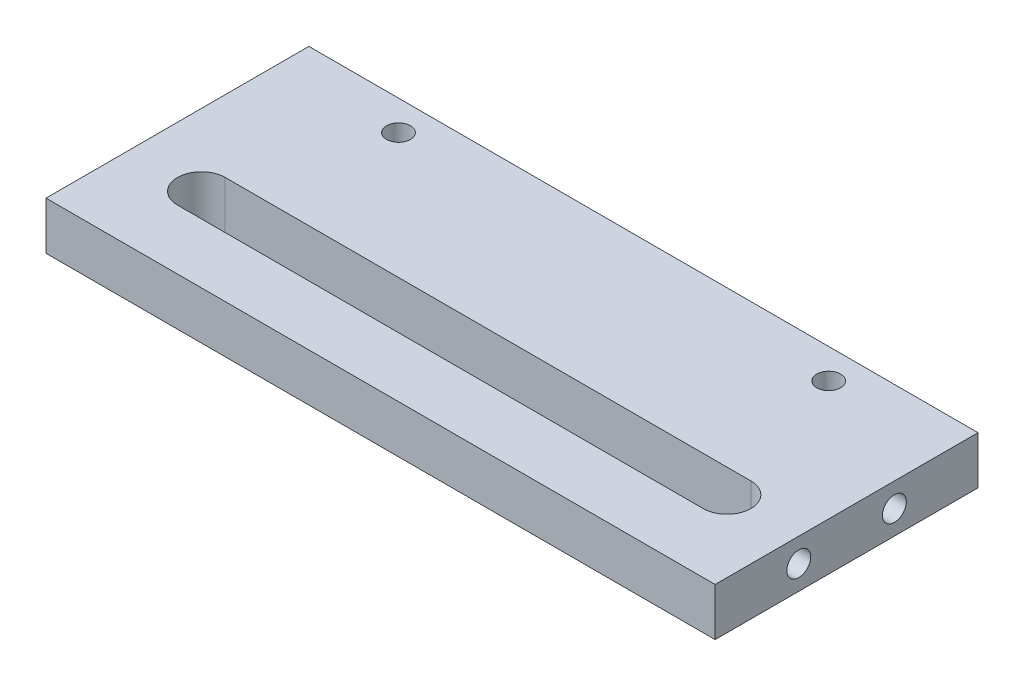
ISO-10303-21;
HEADER;
FILE_DESCRIPTION(('STEP AP214'),'2;1');
FILE_NAME('part.step','',(''),(''),'','','');
FILE_SCHEMA(('AUTOMOTIVE_DESIGN { 1 0 10303 214 1 1 1 1 }'));
ENDSEC;
DATA;
#1=APPLICATION_CONTEXT('core data for automotive mechanical design processes');
#2=APPLICATION_PROTOCOL_DEFINITION('international standard','automotive_design',2000,#1);
#3=PRODUCT_CONTEXT('',#1,'mechanical');
#4=PRODUCT('Part','Part','',(#3));
#5=PRODUCT_RELATED_PRODUCT_CATEGORY('part','',(#4));
#6=PRODUCT_DEFINITION_FORMATION('','',#4);
#7=PRODUCT_DEFINITION_CONTEXT('part definition',#1,'design');
#8=PRODUCT_DEFINITION('design','',#6,#7);
#9=PRODUCT_DEFINITION_SHAPE('','',#8);
#10=(LENGTH_UNIT() NAMED_UNIT(*) SI_UNIT(.MILLI.,.METRE.));
#11=(NAMED_UNIT(*) PLANE_ANGLE_UNIT() SI_UNIT($,.RADIAN.));
#12=(NAMED_UNIT(*) SI_UNIT($,.STERADIAN.) SOLID_ANGLE_UNIT());
#13=UNCERTAINTY_MEASURE_WITH_UNIT(LENGTH_MEASURE(1.E-05),#10,'distance_accuracy_value','');
#14=(GEOMETRIC_REPRESENTATION_CONTEXT(3) GLOBAL_UNCERTAINTY_ASSIGNED_CONTEXT((#13)) GLOBAL_UNIT_ASSIGNED_CONTEXT((#10,
#11,#12)) REPRESENTATION_CONTEXT('',''));
#15=CARTESIAN_POINT('',(0.,0.,0.));
#16=DIRECTION('',(0.,0.,1.));
#17=DIRECTION('',(1.,0.,0.));
#18=AXIS2_PLACEMENT_3D('',#15,#16,#17);
#19=CARTESIAN_POINT('',(0.,20.,0.));
#20=DIRECTION('',(0.,1.,0.));
#21=DIRECTION('',(0.,0.,1.));
#22=AXIS2_PLACEMENT_3D('',#19,#20,#21);
#23=PLANE('',#22);
#24=CARTESIAN_POINT('',(104.294294294294,20.,-44.2567567567568));
#25=DIRECTION('',(0.,1.,0.));
#26=DIRECTION('',(0.,0.,1.));
#27=AXIS2_PLACEMENT_3D('',#24,#25,#26);
#28=CIRCLE('',#27,4.99999999999999);
#29=CARTESIAN_POINT('',(104.294294294294,20.,-39.2567567567568));
#30=VERTEX_POINT('',#29);
#31=EDGE_CURVE('E138',#30,#30,#28,.T.);
#32=ORIENTED_EDGE('',*,*,#31,.F.);
#33=EDGE_LOOP('',(#32));
#34=FACE_BOUND('',#33,.T.);
#35=DIRECTION('',(0.,0.,1.));
#36=VECTOR('',#35,1.);
#37=CARTESIAN_POINT('',(-125.705705705706,20.,-56.7567567567568));
#38=LINE('',#37,#36);
#39=CARTESIAN_POINT('',(-125.705705705706,20.,-56.7567567567568));
#40=VERTEX_POINT('',#39);
#41=CARTESIAN_POINT('',(-125.705705705706,20.,53.2432432432432));
#42=VERTEX_POINT('',#41);
#43=EDGE_CURVE('E148',#40,#42,#38,.T.);
#44=ORIENTED_EDGE('',*,*,#43,.T.);
#45=DIRECTION('',(1.,0.,0.));
#46=VECTOR('',#45,1.);
#47=CARTESIAN_POINT('',(-125.705705705706,20.,53.2432432432432));
#48=LINE('',#47,#46);
#49=CARTESIAN_POINT('',(154.294294294294,20.,53.2432432432432));
#50=VERTEX_POINT('',#49);
#51=EDGE_CURVE('E151',#42,#50,#48,.T.);
#52=ORIENTED_EDGE('',*,*,#51,.T.);
#53=DIRECTION('',(0.,0.,-1.));
#54=VECTOR('',#53,1.);
#55=CARTESIAN_POINT('',(154.294294294294,20.,-56.7567567567568));
#56=LINE('',#55,#54);
#57=CARTESIAN_POINT('',(154.294294294294,20.,-56.7567567567568));
#58=VERTEX_POINT('',#57);
#59=EDGE_CURVE('E154',#50,#58,#56,.T.);
#60=ORIENTED_EDGE('',*,*,#59,.T.);
#61=DIRECTION('',(-1.,0.,0.));
#62=VECTOR('',#61,1.);
#63=CARTESIAN_POINT('',(-125.705705705706,20.,-56.7567567567568));
#64=LINE('',#63,#62);
#65=EDGE_CURVE('E156',#58,#40,#64,.T.);
#66=ORIENTED_EDGE('',*,*,#65,.T.);
#67=EDGE_LOOP('',(#44,#52,#60,#66));
#68=FACE_BOUND('',#67,.T.);
#69=DIRECTION('',(1.,0.,0.));
#70=VECTOR('',#69,1.);
#71=CARTESIAN_POINT('',(-95.7057057057057,20.,28.2432432432432));
#72=LINE('',#71,#70);
#73=CARTESIAN_POINT('',(-95.7057057057057,20.,28.2432432432432));
#74=VERTEX_POINT('',#73);
#75=CARTESIAN_POINT('',(124.294294294294,20.,28.2432432432433));
#76=VERTEX_POINT('',#75);
#77=EDGE_CURVE('E117',#74,#76,#72,.T.);
#78=ORIENTED_EDGE('',*,*,#77,.F.);
#79=CARTESIAN_POINT('',(-95.7057057057057,20.,18.2432432432433));
#80=DIRECTION('',(0.,1.,0.));
#81=DIRECTION('',(0.,0.,1.));
#82=AXIS2_PLACEMENT_3D('',#79,#80,#81);
#83=CIRCLE('',#82,10.);
#84=CARTESIAN_POINT('',(-95.7057057057057,20.,8.24324324324325));
#85=VERTEX_POINT('',#84);
#86=EDGE_CURVE('E109',#85,#74,#83,.T.);
#87=ORIENTED_EDGE('',*,*,#86,.F.);
#88=DIRECTION('',(-1.,0.,0.));
#89=VECTOR('',#88,1.);
#90=CARTESIAN_POINT('',(-95.7057057057057,20.,8.24324324324325));
#91=LINE('',#90,#89);
#92=CARTESIAN_POINT('',(124.294294294294,20.,8.24324324324325));
#93=VERTEX_POINT('',#92);
#94=EDGE_CURVE('E132',#93,#85,#91,.T.);
#95=ORIENTED_EDGE('',*,*,#94,.F.);
#96=CARTESIAN_POINT('',(124.294294294294,20.,18.2432432432433));
#97=DIRECTION('',(0.,1.,0.));
#98=DIRECTION('',(0.,0.,1.));
#99=AXIS2_PLACEMENT_3D('',#96,#97,#98);
#100=CIRCLE('',#99,10.);
#101=EDGE_CURVE('E130',#76,#93,#100,.T.);
#102=ORIENTED_EDGE('',*,*,#101,.F.);
#103=EDGE_LOOP('',(#78,#87,#95,#102));
#104=FACE_BOUND('',#103,.T.);
#105=CARTESIAN_POINT('',(-75.7057057057057,20.,-44.2567567567568));
#106=DIRECTION('',(0.,1.,0.));
#107=DIRECTION('',(0.,0.,1.));
#108=AXIS2_PLACEMENT_3D('',#105,#106,#107);
#109=CIRCLE('',#108,5.00000000000002);
#110=CARTESIAN_POINT('',(-75.7057057057057,20.,-39.2567567567567));
#111=VERTEX_POINT('',#110);
#112=EDGE_CURVE('E297',#111,#111,#109,.T.);
#113=ORIENTED_EDGE('',*,*,#112,.F.);
#114=EDGE_LOOP('',(#113));
#115=FACE_BOUND('',#114,.T.);
#116=ADVANCED_FACE('F44',(#34,#68,#104,#115),#23,.T.);
#117=CARTESIAN_POINT('',(0.,0.,0.));
#118=DIRECTION('',(0.,1.,0.));
#119=DIRECTION('',(0.,0.,1.));
#120=AXIS2_PLACEMENT_3D('',#117,#118,#119);
#121=PLANE('',#120);
#122=CARTESIAN_POINT('',(104.294294294294,0.,-44.2567567567568));
#123=DIRECTION('',(0.,1.,0.));
#124=DIRECTION('',(0.,0.,1.));
#125=AXIS2_PLACEMENT_3D('',#122,#123,#124);
#126=CIRCLE('',#125,4.99999999999999);
#127=CARTESIAN_POINT('',(104.294294294294,0.,-39.2567567567568));
#128=VERTEX_POINT('',#127);
#129=EDGE_CURVE('E300',#128,#128,#126,.T.);
#130=ORIENTED_EDGE('',*,*,#129,.T.);
#131=EDGE_LOOP('',(#130));
#132=FACE_BOUND('',#131,.T.);
#133=DIRECTION('',(0.,0.,1.));
#134=VECTOR('',#133,1.);
#135=CARTESIAN_POINT('',(-125.705705705706,0.,-56.7567567567568));
#136=LINE('',#135,#134);
#137=CARTESIAN_POINT('',(-125.705705705706,0.,-56.7567567567568));
#138=VERTEX_POINT('',#137);
#139=CARTESIAN_POINT('',(-125.705705705706,0.,53.2432432432432));
#140=VERTEX_POINT('',#139);
#141=EDGE_CURVE('E125',#138,#140,#136,.T.);
#142=ORIENTED_EDGE('',*,*,#141,.F.);
#143=DIRECTION('',(-1.,0.,0.));
#144=VECTOR('',#143,1.);
#145=CARTESIAN_POINT('',(-125.705705705706,0.,-56.7567567567568));
#146=LINE('',#145,#144);
#147=CARTESIAN_POINT('',(154.294294294294,0.,-56.7567567567568));
#148=VERTEX_POINT('',#147);
#149=EDGE_CURVE('E152',#148,#138,#146,.T.);
#150=ORIENTED_EDGE('',*,*,#149,.F.);
#151=DIRECTION('',(0.,0.,-1.));
#152=VECTOR('',#151,1.);
#153=CARTESIAN_POINT('',(154.294294294294,0.,-56.7567567567568));
#154=LINE('',#153,#152);
#155=CARTESIAN_POINT('',(154.294294294294,0.,53.2432432432432));
#156=VERTEX_POINT('',#155);
#157=EDGE_CURVE('E163',#156,#148,#154,.T.);
#158=ORIENTED_EDGE('',*,*,#157,.F.);
#159=DIRECTION('',(1.,0.,0.));
#160=VECTOR('',#159,1.);
#161=CARTESIAN_POINT('',(-125.705705705706,0.,53.2432432432432));
#162=LINE('',#161,#160);
#163=EDGE_CURVE('E161',#140,#156,#162,.T.);
#164=ORIENTED_EDGE('',*,*,#163,.F.);
#165=EDGE_LOOP('',(#142,#150,#158,#164));
#166=FACE_BOUND('',#165,.T.);
#167=CARTESIAN_POINT('',(-95.7057057057057,0.,18.2432432432433));
#168=DIRECTION('',(0.,1.,0.));
#169=DIRECTION('',(0.,0.,1.));
#170=AXIS2_PLACEMENT_3D('',#167,#168,#169);
#171=CIRCLE('',#170,10.);
#172=CARTESIAN_POINT('',(-95.7057057057057,0.,8.24324324324325));
#173=VERTEX_POINT('',#172);
#174=CARTESIAN_POINT('',(-95.7057057057057,0.,28.2432432432432));
#175=VERTEX_POINT('',#174);
#176=EDGE_CURVE('E67',#173,#175,#171,.T.);
#177=ORIENTED_EDGE('',*,*,#176,.T.);
#178=DIRECTION('',(1.,0.,0.));
#179=VECTOR('',#178,1.);
#180=CARTESIAN_POINT('',(-95.7057057057057,0.,28.2432432432432));
#181=LINE('',#180,#179);
#182=CARTESIAN_POINT('',(124.294294294294,0.,28.2432432432433));
#183=VERTEX_POINT('',#182);
#184=EDGE_CURVE('E124',#175,#183,#181,.T.);
#185=ORIENTED_EDGE('',*,*,#184,.T.);
#186=CARTESIAN_POINT('',(124.294294294294,0.,18.2432432432433));
#187=DIRECTION('',(0.,1.,0.));
#188=DIRECTION('',(0.,0.,1.));
#189=AXIS2_PLACEMENT_3D('',#186,#187,#188);
#190=CIRCLE('',#189,10.);
#191=CARTESIAN_POINT('',(124.294294294294,0.,8.24324324324325));
#192=VERTEX_POINT('',#191);
#193=EDGE_CURVE('E140',#183,#192,#190,.T.);
#194=ORIENTED_EDGE('',*,*,#193,.T.);
#195=DIRECTION('',(-1.,0.,0.));
#196=VECTOR('',#195,1.);
#197=CARTESIAN_POINT('',(-95.7057057057057,0.,8.24324324324325));
#198=LINE('',#197,#196);
#199=EDGE_CURVE('E118',#192,#173,#198,.T.);
#200=ORIENTED_EDGE('',*,*,#199,.T.);
#201=EDGE_LOOP('',(#177,#185,#194,#200));
#202=FACE_BOUND('',#201,.T.);
#203=CARTESIAN_POINT('',(-75.7057057057057,0.,-44.2567567567568));
#204=DIRECTION('',(0.,1.,0.));
#205=DIRECTION('',(0.,0.,1.));
#206=AXIS2_PLACEMENT_3D('',#203,#204,#205);
#207=CIRCLE('',#206,5.00000000000002);
#208=CARTESIAN_POINT('',(-75.7057057057057,0.,-39.2567567567567));
#209=VERTEX_POINT('',#208);
#210=EDGE_CURVE('E294',#209,#209,#207,.T.);
#211=ORIENTED_EDGE('',*,*,#210,.T.);
#212=EDGE_LOOP('',(#211));
#213=FACE_BOUND('',#212,.T.);
#214=ADVANCED_FACE('F181',(#132,#166,#202,#213),#121,.F.);
#215=CARTESIAN_POINT('',(-125.705705705706,20.,-56.7567567567568));
#216=DIRECTION('',(1.,0.,0.));
#217=DIRECTION('',(0.,0.,-1.));
#218=AXIS2_PLACEMENT_3D('',#215,#216,#217);
#219=PLANE('',#218);
#220=CARTESIAN_POINT('',(-125.705705705706,10.,-21.7567567567568));
#221=DIRECTION('',(-1.,0.,0.));
#222=DIRECTION('',(0.,0.,1.));
#223=AXIS2_PLACEMENT_3D('',#220,#221,#222);
#224=CIRCLE('',#223,5.);
#225=CARTESIAN_POINT('',(-125.705705705706,10.,-16.7567567567568));
#226=VERTEX_POINT('',#225);
#227=EDGE_CURVE('E283',#226,#226,#224,.T.);
#228=ORIENTED_EDGE('',*,*,#227,.F.);
#229=EDGE_LOOP('',(#228));
#230=FACE_BOUND('',#229,.T.);
#231=CARTESIAN_POINT('',(-125.705705705706,10.,18.2432432432432));
#232=DIRECTION('',(-1.,0.,0.));
#233=DIRECTION('',(0.,0.,1.));
#234=AXIS2_PLACEMENT_3D('',#231,#232,#233);
#235=CIRCLE('',#234,5.);
#236=CARTESIAN_POINT('',(-125.705705705706,10.,23.2432432432432));
#237=VERTEX_POINT('',#236);
#238=EDGE_CURVE('E288',#237,#237,#235,.T.);
#239=ORIENTED_EDGE('',*,*,#238,.F.);
#240=EDGE_LOOP('',(#239));
#241=FACE_BOUND('',#240,.T.);
#242=ORIENTED_EDGE('',*,*,#141,.T.);
#243=DIRECTION('',(0.,-1.,0.));
#244=VECTOR('',#243,1.);
#245=CARTESIAN_POINT('',(-125.705705705706,20.,53.2432432432432));
#246=LINE('',#245,#244);
#247=EDGE_CURVE('E13',#42,#140,#246,.T.);
#248=ORIENTED_EDGE('',*,*,#247,.F.);
#249=ORIENTED_EDGE('',*,*,#43,.F.);
#250=DIRECTION('',(0.,-1.,0.));
#251=VECTOR('',#250,1.);
#252=CARTESIAN_POINT('',(-125.705705705706,20.,-56.7567567567568));
#253=LINE('',#252,#251);
#254=EDGE_CURVE('E158',#40,#138,#253,.T.);
#255=ORIENTED_EDGE('',*,*,#254,.T.);
#256=EDGE_LOOP('',(#242,#248,#249,#255));
#257=FACE_BOUND('',#256,.T.);
#258=ADVANCED_FACE('F46',(#230,#241,#257),#219,.F.);
#259=CARTESIAN_POINT('',(-125.705705705706,20.,53.2432432432432));
#260=DIRECTION('',(0.,0.,-1.));
#261=DIRECTION('',(-1.,0.,0.));
#262=AXIS2_PLACEMENT_3D('',#259,#260,#261);
#263=PLANE('',#262);
#264=ORIENTED_EDGE('',*,*,#163,.T.);
#265=DIRECTION('',(0.,-1.,0.));
#266=VECTOR('',#265,1.);
#267=CARTESIAN_POINT('',(154.294294294294,20.,53.2432432432432));
#268=LINE('',#267,#266);
#269=EDGE_CURVE('E52',#50,#156,#268,.T.);
#270=ORIENTED_EDGE('',*,*,#269,.F.);
#271=ORIENTED_EDGE('',*,*,#51,.F.);
#272=ORIENTED_EDGE('',*,*,#247,.T.);
#273=EDGE_LOOP('',(#264,#270,#271,#272));
#274=FACE_BOUND('',#273,.T.);
#275=ADVANCED_FACE('F191',(#274),#263,.F.);
#276=CARTESIAN_POINT('',(154.294294294294,20.,-56.7567567567568));
#277=DIRECTION('',(-1.,0.,0.));
#278=DIRECTION('',(0.,0.,1.));
#279=AXIS2_PLACEMENT_3D('',#276,#277,#278);
#280=PLANE('',#279);
#281=CARTESIAN_POINT('',(154.294294294294,10.,18.2432432432432));
#282=DIRECTION('',(1.,0.,0.));
#283=DIRECTION('',(0.,0.,-1.));
#284=AXIS2_PLACEMENT_3D('',#281,#282,#283);
#285=CIRCLE('',#284,5.);
#286=CARTESIAN_POINT('',(154.294294294294,10.,13.2432432432432));
#287=VERTEX_POINT('',#286);
#288=EDGE_CURVE('E274',#287,#287,#285,.T.);
#289=ORIENTED_EDGE('',*,*,#288,.F.);
#290=EDGE_LOOP('',(#289));
#291=FACE_BOUND('',#290,.T.);
#292=CARTESIAN_POINT('',(154.294294294294,10.,-21.7567567567568));
#293=DIRECTION('',(1.,0.,0.));
#294=DIRECTION('',(0.,0.,-1.));
#295=AXIS2_PLACEMENT_3D('',#292,#293,#294);
#296=CIRCLE('',#295,5.);
#297=CARTESIAN_POINT('',(154.294294294294,10.,-26.7567567567568));
#298=VERTEX_POINT('',#297);
#299=EDGE_CURVE('E273',#298,#298,#296,.T.);
#300=ORIENTED_EDGE('',*,*,#299,.F.);
#301=EDGE_LOOP('',(#300));
#302=FACE_BOUND('',#301,.T.);
#303=ORIENTED_EDGE('',*,*,#157,.T.);
#304=DIRECTION('',(0.,-1.,0.));
#305=VECTOR('',#304,1.);
#306=CARTESIAN_POINT('',(154.294294294294,20.,-56.7567567567568));
#307=LINE('',#306,#305);
#308=EDGE_CURVE('E168',#58,#148,#307,.T.);
#309=ORIENTED_EDGE('',*,*,#308,.F.);
#310=ORIENTED_EDGE('',*,*,#59,.F.);
#311=ORIENTED_EDGE('',*,*,#269,.T.);
#312=EDGE_LOOP('',(#303,#309,#310,#311));
#313=FACE_BOUND('',#312,.T.);
#314=ADVANCED_FACE('F175',(#291,#302,#313),#280,.F.);
#315=CARTESIAN_POINT('',(-125.705705705706,20.,-56.7567567567568));
#316=DIRECTION('',(0.,0.,1.));
#317=DIRECTION('',(1.,0.,0.));
#318=AXIS2_PLACEMENT_3D('',#315,#316,#317);
#319=PLANE('',#318);
#320=ORIENTED_EDGE('',*,*,#149,.T.);
#321=ORIENTED_EDGE('',*,*,#254,.F.);
#322=ORIENTED_EDGE('',*,*,#65,.F.);
#323=ORIENTED_EDGE('',*,*,#308,.T.);
#324=EDGE_LOOP('',(#320,#321,#322,#323));
#325=FACE_BOUND('',#324,.T.);
#326=ADVANCED_FACE('F185',(#325),#319,.F.);
#327=CARTESIAN_POINT('',(-95.7057057057057,20.,18.2432432432433));
#328=DIRECTION('',(0.,-1.,0.));
#329=DIRECTION('',(0.,0.,-1.));
#330=AXIS2_PLACEMENT_3D('',#327,#328,#329);
#331=CYLINDRICAL_SURFACE('',#330,10.);
#332=ORIENTED_EDGE('',*,*,#176,.F.);
#333=DIRECTION('',(0.,-1.,0.));
#334=VECTOR('',#333,1.);
#335=CARTESIAN_POINT('',(-95.7057057057057,20.,8.24324324324325));
#336=LINE('',#335,#334);
#337=EDGE_CURVE('E113',#85,#173,#336,.T.);
#338=ORIENTED_EDGE('',*,*,#337,.F.);
#339=ORIENTED_EDGE('',*,*,#86,.T.);
#340=DIRECTION('',(0.,-1.,0.));
#341=VECTOR('',#340,1.);
#342=CARTESIAN_POINT('',(-95.7057057057057,20.,28.2432432432432));
#343=LINE('',#342,#341);
#344=EDGE_CURVE('E112',#74,#175,#343,.T.);
#345=ORIENTED_EDGE('',*,*,#344,.T.);
#346=EDGE_LOOP('',(#332,#338,#339,#345));
#347=FACE_BOUND('',#346,.T.);
#348=ADVANCED_FACE('F111',(#347),#331,.F.);
#349=CARTESIAN_POINT('',(-95.7057057057057,20.,28.2432432432432));
#350=DIRECTION('',(0.,0.,-1.));
#351=DIRECTION('',(-1.,0.,0.));
#352=AXIS2_PLACEMENT_3D('',#349,#350,#351);
#353=PLANE('',#352);
#354=ORIENTED_EDGE('',*,*,#184,.F.);
#355=ORIENTED_EDGE('',*,*,#344,.F.);
#356=ORIENTED_EDGE('',*,*,#77,.T.);
#357=DIRECTION('',(0.,-1.,0.));
#358=VECTOR('',#357,1.);
#359=CARTESIAN_POINT('',(124.294294294294,20.,28.2432432432433));
#360=LINE('',#359,#358);
#361=EDGE_CURVE('E126',#76,#183,#360,.T.);
#362=ORIENTED_EDGE('',*,*,#361,.T.);
#363=EDGE_LOOP('',(#354,#355,#356,#362));
#364=FACE_BOUND('',#363,.T.);
#365=ADVANCED_FACE('F121',(#364),#353,.T.);
#366=CARTESIAN_POINT('',(124.294294294294,20.,18.2432432432433));
#367=DIRECTION('',(0.,-1.,0.));
#368=DIRECTION('',(0.,0.,-1.));
#369=AXIS2_PLACEMENT_3D('',#366,#367,#368);
#370=CYLINDRICAL_SURFACE('',#369,10.);
#371=ORIENTED_EDGE('',*,*,#193,.F.);
#372=ORIENTED_EDGE('',*,*,#361,.F.);
#373=ORIENTED_EDGE('',*,*,#101,.T.);
#374=DIRECTION('',(0.,-1.,0.));
#375=VECTOR('',#374,1.);
#376=CARTESIAN_POINT('',(124.294294294294,20.,8.24324324324325));
#377=LINE('',#376,#375);
#378=EDGE_CURVE('E59',#93,#192,#377,.T.);
#379=ORIENTED_EDGE('',*,*,#378,.T.);
#380=EDGE_LOOP('',(#371,#372,#373,#379));
#381=FACE_BOUND('',#380,.T.);
#382=ADVANCED_FACE('F219',(#381),#370,.F.);
#383=CARTESIAN_POINT('',(-95.7057057057057,20.,8.24324324324325));
#384=DIRECTION('',(0.,0.,1.));
#385=DIRECTION('',(1.,0.,0.));
#386=AXIS2_PLACEMENT_3D('',#383,#384,#385);
#387=PLANE('',#386);
#388=ORIENTED_EDGE('',*,*,#199,.F.);
#389=ORIENTED_EDGE('',*,*,#378,.F.);
#390=ORIENTED_EDGE('',*,*,#94,.T.);
#391=ORIENTED_EDGE('',*,*,#337,.T.);
#392=EDGE_LOOP('',(#388,#389,#390,#391));
#393=FACE_BOUND('',#392,.T.);
#394=ADVANCED_FACE('F223',(#393),#387,.T.);
#395=CARTESIAN_POINT('',(104.294294294294,20.,-44.2567567567568));
#396=DIRECTION('',(0.,-1.,0.));
#397=DIRECTION('',(0.,0.,-1.));
#398=AXIS2_PLACEMENT_3D('',#395,#396,#397);
#399=CYLINDRICAL_SURFACE('',#398,4.99999999999999);
#400=ORIENTED_EDGE('',*,*,#31,.T.);
#401=EDGE_LOOP('',(#400));
#402=FACE_BOUND('',#401,.T.);
#403=ORIENTED_EDGE('',*,*,#129,.F.);
#404=EDGE_LOOP('',(#403));
#405=FACE_BOUND('',#404,.T.);
#406=ADVANCED_FACE('F229',(#402,#405),#399,.F.);
#407=CARTESIAN_POINT('',(-75.7057057057057,20.,-44.2567567567568));
#408=DIRECTION('',(0.,-1.,0.));
#409=DIRECTION('',(0.,0.,-1.));
#410=AXIS2_PLACEMENT_3D('',#407,#408,#409);
#411=CYLINDRICAL_SURFACE('',#410,5.00000000000002);
#412=ORIENTED_EDGE('',*,*,#112,.T.);
#413=EDGE_LOOP('',(#412));
#414=FACE_BOUND('',#413,.T.);
#415=ORIENTED_EDGE('',*,*,#210,.F.);
#416=EDGE_LOOP('',(#415));
#417=FACE_BOUND('',#416,.T.);
#418=ADVANCED_FACE('F232',(#414,#417),#411,.F.);
#419=CARTESIAN_POINT('',(-107.705705705706,10.,18.2432432432432));
#420=DIRECTION('',(-1.,0.,0.));
#421=DIRECTION('',(0.,0.,1.));
#422=AXIS2_PLACEMENT_3D('',#419,#420,#421);
#423=CYLINDRICAL_SURFACE('',#422,5.);
#424=CARTESIAN_POINT('',(-107.705705705706,10.,18.2432432432432));
#425=DIRECTION('',(-1.,0.,0.));
#426=DIRECTION('',(0.,0.,1.));
#427=AXIS2_PLACEMENT_3D('',#424,#425,#426);
#428=CIRCLE('',#427,5.);
#429=CARTESIAN_POINT('',(-107.705705705706,10.,23.2432432432432));
#430=VERTEX_POINT('',#429);
#431=EDGE_CURVE('E291',#430,#430,#428,.T.);
#432=ORIENTED_EDGE('',*,*,#431,.F.);
#433=EDGE_LOOP('',(#432));
#434=FACE_BOUND('',#433,.T.);
#435=ORIENTED_EDGE('',*,*,#238,.T.);
#436=EDGE_LOOP('',(#435));
#437=FACE_BOUND('',#436,.T.);
#438=ADVANCED_FACE('F236',(#434,#437),#423,.F.);
#439=CARTESIAN_POINT('',(-107.705705705706,10.,18.2432432432432));
#440=DIRECTION('',(-1.,0.,0.));
#441=DIRECTION('',(0.,0.,1.));
#442=AXIS2_PLACEMENT_3D('',#439,#440,#441);
#443=PLANE('',#442);
#444=ORIENTED_EDGE('',*,*,#431,.T.);
#445=EDGE_LOOP('',(#444));
#446=FACE_BOUND('',#445,.T.);
#447=ADVANCED_FACE('F240',(#446),#443,.T.);
#448=CARTESIAN_POINT('',(-107.705705705706,10.,-21.7567567567568));
#449=DIRECTION('',(-1.,0.,0.));
#450=DIRECTION('',(0.,0.,1.));
#451=AXIS2_PLACEMENT_3D('',#448,#449,#450);
#452=CYLINDRICAL_SURFACE('',#451,5.);
#453=CARTESIAN_POINT('',(-107.705705705706,10.,-21.7567567567568));
#454=DIRECTION('',(-1.,0.,0.));
#455=DIRECTION('',(0.,0.,1.));
#456=AXIS2_PLACEMENT_3D('',#453,#454,#455);
#457=CIRCLE('',#456,5.);
#458=CARTESIAN_POINT('',(-107.705705705706,10.,-16.7567567567568));
#459=VERTEX_POINT('',#458);
#460=EDGE_CURVE('E285',#459,#459,#457,.T.);
#461=ORIENTED_EDGE('',*,*,#460,.F.);
#462=EDGE_LOOP('',(#461));
#463=FACE_BOUND('',#462,.T.);
#464=ORIENTED_EDGE('',*,*,#227,.T.);
#465=EDGE_LOOP('',(#464));
#466=FACE_BOUND('',#465,.T.);
#467=ADVANCED_FACE('F244',(#463,#466),#452,.F.);
#468=CARTESIAN_POINT('',(-107.705705705706,10.,-21.7567567567568));
#469=DIRECTION('',(-1.,0.,0.));
#470=DIRECTION('',(0.,0.,1.));
#471=AXIS2_PLACEMENT_3D('',#468,#469,#470);
#472=PLANE('',#471);
#473=ORIENTED_EDGE('',*,*,#460,.T.);
#474=EDGE_LOOP('',(#473));
#475=FACE_BOUND('',#474,.T.);
#476=ADVANCED_FACE('F248',(#475),#472,.T.);
#477=CARTESIAN_POINT('',(136.294294294294,10.,-21.7567567567568));
#478=DIRECTION('',(1.,0.,0.));
#479=DIRECTION('',(0.,0.,-1.));
#480=AXIS2_PLACEMENT_3D('',#477,#478,#479);
#481=CYLINDRICAL_SURFACE('',#480,5.);
#482=CARTESIAN_POINT('',(136.294294294294,10.,-21.7567567567568));
#483=DIRECTION('',(1.,0.,0.));
#484=DIRECTION('',(0.,0.,-1.));
#485=AXIS2_PLACEMENT_3D('',#482,#483,#484);
#486=CIRCLE('',#485,5.);
#487=CARTESIAN_POINT('',(136.294294294294,10.,-26.7567567567568));
#488=VERTEX_POINT('',#487);
#489=EDGE_CURVE('E277',#488,#488,#486,.T.);
#490=ORIENTED_EDGE('',*,*,#489,.F.);
#491=EDGE_LOOP('',(#490));
#492=FACE_BOUND('',#491,.T.);
#493=ORIENTED_EDGE('',*,*,#299,.T.);
#494=EDGE_LOOP('',(#493));
#495=FACE_BOUND('',#494,.T.);
#496=ADVANCED_FACE('F252',(#492,#495),#481,.F.);
#497=CARTESIAN_POINT('',(136.294294294294,10.,-21.7567567567568));
#498=DIRECTION('',(1.,0.,0.));
#499=DIRECTION('',(0.,0.,-1.));
#500=AXIS2_PLACEMENT_3D('',#497,#498,#499);
#501=PLANE('',#500);
#502=ORIENTED_EDGE('',*,*,#489,.T.);
#503=EDGE_LOOP('',(#502));
#504=FACE_BOUND('',#503,.T.);
#505=ADVANCED_FACE('F256',(#504),#501,.T.);
#506=CARTESIAN_POINT('',(136.294294294294,10.,18.2432432432432));
#507=DIRECTION('',(1.,0.,0.));
#508=DIRECTION('',(0.,0.,-1.));
#509=AXIS2_PLACEMENT_3D('',#506,#507,#508);
#510=CYLINDRICAL_SURFACE('',#509,5.);
#511=CARTESIAN_POINT('',(136.294294294294,10.,18.2432432432432));
#512=DIRECTION('',(1.,0.,0.));
#513=DIRECTION('',(0.,0.,-1.));
#514=AXIS2_PLACEMENT_3D('',#511,#512,#513);
#515=CIRCLE('',#514,5.);
#516=CARTESIAN_POINT('',(136.294294294294,10.,13.2432432432432));
#517=VERTEX_POINT('',#516);
#518=EDGE_CURVE('E272',#517,#517,#515,.T.);
#519=ORIENTED_EDGE('',*,*,#518,.F.);
#520=EDGE_LOOP('',(#519));
#521=FACE_BOUND('',#520,.T.);
#522=ORIENTED_EDGE('',*,*,#288,.T.);
#523=EDGE_LOOP('',(#522));
#524=FACE_BOUND('',#523,.T.);
#525=ADVANCED_FACE('F260',(#521,#524),#510,.F.);
#526=CARTESIAN_POINT('',(136.294294294294,10.,18.2432432432432));
#527=DIRECTION('',(1.,0.,0.));
#528=DIRECTION('',(0.,0.,-1.));
#529=AXIS2_PLACEMENT_3D('',#526,#527,#528);
#530=PLANE('',#529);
#531=ORIENTED_EDGE('',*,*,#518,.T.);
#532=EDGE_LOOP('',(#531));
#533=FACE_BOUND('',#532,.T.);
#534=ADVANCED_FACE('F264',(#533),#530,.T.);
#535=CLOSED_SHELL('',(#116,#214,#258,#275,#314,#326,#348,#365,#382,#394,#406,#418,#438,#447,
#467,#476,#496,#505,#525,#534));
#536=MANIFOLD_SOLID_BREP('B2',#535);
#537=ADVANCED_BREP_SHAPE_REPRESENTATION('',(#18,#536),#14);
#538=SHAPE_DEFINITION_REPRESENTATION(#9,#537);
ENDSEC;
END-ISO-10303-21;
